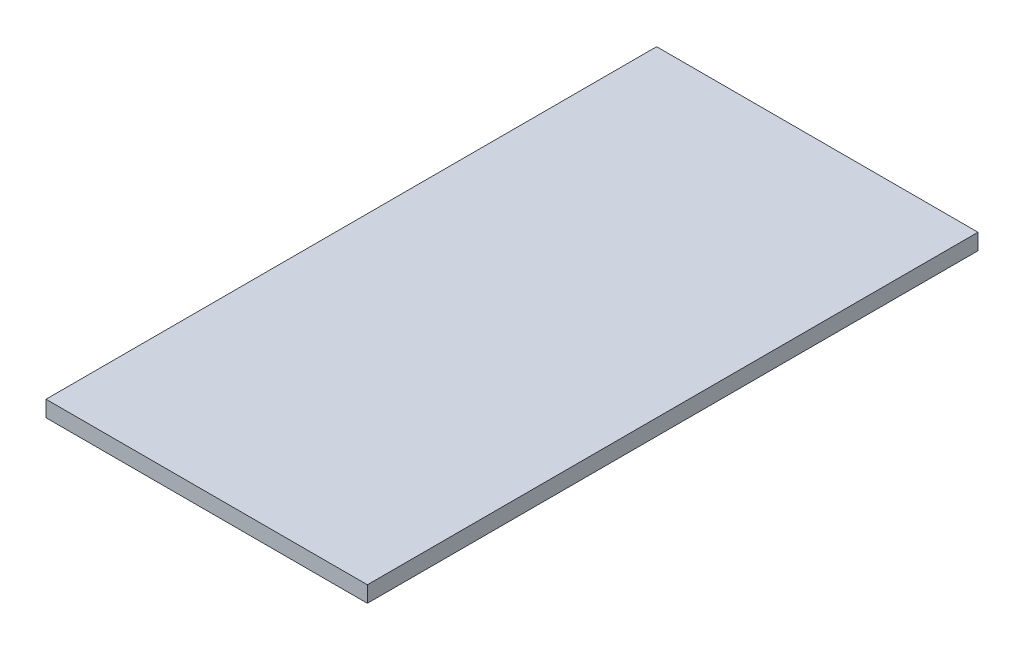
ISO-10303-21;
HEADER;
FILE_DESCRIPTION(('STEP AP214'),'2;1');
FILE_NAME('part.step','',(''),(''),'','','');
FILE_SCHEMA(('AUTOMOTIVE_DESIGN { 1 0 10303 214 1 1 1 1 }'));
ENDSEC;
DATA;
#1=APPLICATION_CONTEXT('core data for automotive mechanical design processes');
#2=APPLICATION_PROTOCOL_DEFINITION('international standard','automotive_design',2000,#1);
#3=PRODUCT_CONTEXT('',#1,'mechanical');
#4=PRODUCT('Part','Part','',(#3));
#5=PRODUCT_RELATED_PRODUCT_CATEGORY('part','',(#4));
#6=PRODUCT_DEFINITION_FORMATION('','',#4);
#7=PRODUCT_DEFINITION_CONTEXT('part definition',#1,'design');
#8=PRODUCT_DEFINITION('design','',#6,#7);
#9=PRODUCT_DEFINITION_SHAPE('','',#8);
#10=(LENGTH_UNIT() NAMED_UNIT(*) SI_UNIT(.MILLI.,.METRE.));
#11=(NAMED_UNIT(*) PLANE_ANGLE_UNIT() SI_UNIT($,.RADIAN.));
#12=(NAMED_UNIT(*) SI_UNIT($,.STERADIAN.) SOLID_ANGLE_UNIT());
#13=UNCERTAINTY_MEASURE_WITH_UNIT(LENGTH_MEASURE(1.E-05),#10,'distance_accuracy_value','');
#14=(GEOMETRIC_REPRESENTATION_CONTEXT(3) GLOBAL_UNCERTAINTY_ASSIGNED_CONTEXT((#13)) GLOBAL_UNIT_ASSIGNED_CONTEXT((#10,
#11,#12)) REPRESENTATION_CONTEXT('',''));
#15=CARTESIAN_POINT('',(0.,0.,0.));
#16=DIRECTION('',(0.,0.,1.));
#17=DIRECTION('',(1.,0.,0.));
#18=AXIS2_PLACEMENT_3D('',#15,#16,#17);
#19=CARTESIAN_POINT('',(10.,1.,-19.));
#20=DIRECTION('',(-1.,0.,0.));
#21=DIRECTION('',(0.,0.,1.));
#22=AXIS2_PLACEMENT_3D('',#19,#20,#21);
#23=PLANE('',#22);
#24=DIRECTION('',(0.,0.,-1.));
#25=VECTOR('',#24,1.);
#26=CARTESIAN_POINT('',(10.,0.,-19.));
#27=LINE('',#26,#25);
#28=CARTESIAN_POINT('',(10.,0.,19.));
#29=VERTEX_POINT('',#28);
#30=CARTESIAN_POINT('',(10.,0.,-19.));
#31=VERTEX_POINT('',#30);
#32=EDGE_CURVE('E107',#29,#31,#27,.T.);
#33=ORIENTED_EDGE('',*,*,#32,.T.);
#34=DIRECTION('',(0.,-1.,0.));
#35=VECTOR('',#34,1.);
#36=CARTESIAN_POINT('',(10.,1.,-19.));
#37=LINE('',#36,#35);
#38=CARTESIAN_POINT('',(10.,1.,-19.));
#39=VERTEX_POINT('',#38);
#40=EDGE_CURVE('E11',#39,#31,#37,.T.);
#41=ORIENTED_EDGE('',*,*,#40,.F.);
#42=DIRECTION('',(0.,0.,-1.));
#43=VECTOR('',#42,1.);
#44=CARTESIAN_POINT('',(10.,1.,-19.));
#45=LINE('',#44,#43);
#46=CARTESIAN_POINT('',(10.,1.,19.));
#47=VERTEX_POINT('',#46);
#48=EDGE_CURVE('E91',#47,#39,#45,.T.);
#49=ORIENTED_EDGE('',*,*,#48,.F.);
#50=DIRECTION('',(0.,-1.,0.));
#51=VECTOR('',#50,1.);
#52=CARTESIAN_POINT('',(10.,1.,19.));
#53=LINE('',#52,#51);
#54=EDGE_CURVE('E103',#47,#29,#53,.T.);
#55=ORIENTED_EDGE('',*,*,#54,.T.);
#56=EDGE_LOOP('',(#33,#41,#49,#55));
#57=FACE_BOUND('',#56,.T.);
#58=ADVANCED_FACE('F39',(#57),#23,.F.);
#59=CARTESIAN_POINT('',(-10.,1.,-19.));
#60=DIRECTION('',(0.,0.,1.));
#61=DIRECTION('',(1.,0.,0.));
#62=AXIS2_PLACEMENT_3D('',#59,#60,#61);
#63=PLANE('',#62);
#64=DIRECTION('',(-1.,0.,0.));
#65=VECTOR('',#64,1.);
#66=CARTESIAN_POINT('',(-10.,0.,-19.));
#67=LINE('',#66,#65);
#68=CARTESIAN_POINT('',(-10.,0.,-19.));
#69=VERTEX_POINT('',#68);
#70=EDGE_CURVE('E96',#31,#69,#67,.T.);
#71=ORIENTED_EDGE('',*,*,#70,.T.);
#72=DIRECTION('',(0.,-1.,0.));
#73=VECTOR('',#72,1.);
#74=CARTESIAN_POINT('',(-10.,1.,-19.));
#75=LINE('',#74,#73);
#76=CARTESIAN_POINT('',(-10.,1.,-19.));
#77=VERTEX_POINT('',#76);
#78=EDGE_CURVE('E48',#77,#69,#75,.T.);
#79=ORIENTED_EDGE('',*,*,#78,.F.);
#80=DIRECTION('',(-1.,0.,0.));
#81=VECTOR('',#80,1.);
#82=CARTESIAN_POINT('',(-10.,1.,-19.));
#83=LINE('',#82,#81);
#84=EDGE_CURVE('E86',#39,#77,#83,.T.);
#85=ORIENTED_EDGE('',*,*,#84,.F.);
#86=ORIENTED_EDGE('',*,*,#40,.T.);
#87=EDGE_LOOP('',(#71,#79,#85,#86));
#88=FACE_BOUND('',#87,.T.);
#89=ADVANCED_FACE('F95',(#88),#63,.F.);
#90=CARTESIAN_POINT('',(-10.,1.,-19.));
#91=DIRECTION('',(1.,0.,0.));
#92=DIRECTION('',(0.,0.,-1.));
#93=AXIS2_PLACEMENT_3D('',#90,#91,#92);
#94=PLANE('',#93);
#95=DIRECTION('',(0.,0.,1.));
#96=VECTOR('',#95,1.);
#97=CARTESIAN_POINT('',(-10.,0.,-19.));
#98=LINE('',#97,#96);
#99=CARTESIAN_POINT('',(-10.,0.,19.));
#100=VERTEX_POINT('',#99);
#101=EDGE_CURVE('E73',#69,#100,#98,.T.);
#102=ORIENTED_EDGE('',*,*,#101,.T.);
#103=DIRECTION('',(0.,-1.,0.));
#104=VECTOR('',#103,1.);
#105=CARTESIAN_POINT('',(-10.,1.,19.));
#106=LINE('',#105,#104);
#107=CARTESIAN_POINT('',(-10.,1.,19.));
#108=VERTEX_POINT('',#107);
#109=EDGE_CURVE('E98',#108,#100,#106,.T.);
#110=ORIENTED_EDGE('',*,*,#109,.F.);
#111=DIRECTION('',(0.,0.,1.));
#112=VECTOR('',#111,1.);
#113=CARTESIAN_POINT('',(-10.,1.,-19.));
#114=LINE('',#113,#112);
#115=EDGE_CURVE('E89',#77,#108,#114,.T.);
#116=ORIENTED_EDGE('',*,*,#115,.F.);
#117=ORIENTED_EDGE('',*,*,#78,.T.);
#118=EDGE_LOOP('',(#102,#110,#116,#117));
#119=FACE_BOUND('',#118,.T.);
#120=ADVANCED_FACE('F99',(#119),#94,.F.);
#121=CARTESIAN_POINT('',(-10.,1.,19.));
#122=DIRECTION('',(0.,0.,-1.));
#123=DIRECTION('',(-1.,0.,0.));
#124=AXIS2_PLACEMENT_3D('',#121,#122,#123);
#125=PLANE('',#124);
#126=DIRECTION('',(1.,0.,0.));
#127=VECTOR('',#126,1.);
#128=CARTESIAN_POINT('',(-10.,0.,19.));
#129=LINE('',#128,#127);
#130=EDGE_CURVE('E79',#100,#29,#129,.T.);
#131=ORIENTED_EDGE('',*,*,#130,.T.);
#132=ORIENTED_EDGE('',*,*,#54,.F.);
#133=DIRECTION('',(1.,0.,0.));
#134=VECTOR('',#133,1.);
#135=CARTESIAN_POINT('',(-10.,1.,19.));
#136=LINE('',#135,#134);
#137=EDGE_CURVE('E56',#108,#47,#136,.T.);
#138=ORIENTED_EDGE('',*,*,#137,.F.);
#139=ORIENTED_EDGE('',*,*,#109,.T.);
#140=EDGE_LOOP('',(#131,#132,#138,#139));
#141=FACE_BOUND('',#140,.T.);
#142=ADVANCED_FACE('F120',(#141),#125,.F.);
#143=CARTESIAN_POINT('',(0.,1.,0.));
#144=DIRECTION('',(0.,1.,0.));
#145=DIRECTION('',(0.,0.,1.));
#146=AXIS2_PLACEMENT_3D('',#143,#144,#145);
#147=PLANE('',#146);
#148=ORIENTED_EDGE('',*,*,#48,.T.);
#149=ORIENTED_EDGE('',*,*,#84,.T.);
#150=ORIENTED_EDGE('',*,*,#115,.T.);
#151=ORIENTED_EDGE('',*,*,#137,.T.);
#152=EDGE_LOOP('',(#148,#149,#150,#151));
#153=FACE_BOUND('',#152,.T.);
#154=ADVANCED_FACE('F87',(#153),#147,.T.);
#155=CARTESIAN_POINT('',(0.,0.,0.));
#156=DIRECTION('',(0.,1.,0.));
#157=DIRECTION('',(0.,0.,1.));
#158=AXIS2_PLACEMENT_3D('',#155,#156,#157);
#159=PLANE('',#158);
#160=ORIENTED_EDGE('',*,*,#32,.F.);
#161=ORIENTED_EDGE('',*,*,#130,.F.);
#162=ORIENTED_EDGE('',*,*,#101,.F.);
#163=ORIENTED_EDGE('',*,*,#70,.F.);
#164=EDGE_LOOP('',(#160,#161,#162,#163));
#165=FACE_BOUND('',#164,.T.);
#166=ADVANCED_FACE('F123',(#165),#159,.F.);
#167=CLOSED_SHELL('',(#58,#89,#120,#142,#154,#166));
#168=MANIFOLD_SOLID_BREP('B2',#167);
#169=ADVANCED_BREP_SHAPE_REPRESENTATION('',(#18,#168),#14);
#170=SHAPE_DEFINITION_REPRESENTATION(#9,#169);
ENDSEC;
END-ISO-10303-21;
